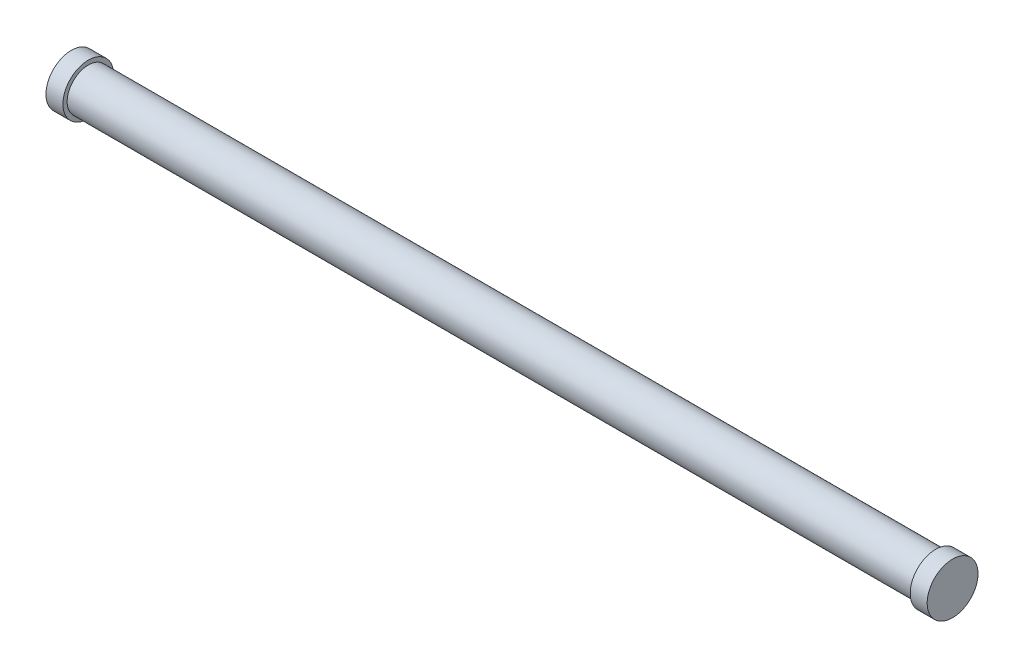
ISO-10303-21;
HEADER;
FILE_DESCRIPTION(('STEP AP214'),'2;1');
FILE_NAME('part.step','',(''),(''),'','','');
FILE_SCHEMA(('AUTOMOTIVE_DESIGN { 1 0 10303 214 1 1 1 1 }'));
ENDSEC;
DATA;
#1=APPLICATION_CONTEXT('core data for automotive mechanical design processes');
#2=APPLICATION_PROTOCOL_DEFINITION('international standard','automotive_design',2000,#1);
#3=PRODUCT_CONTEXT('',#1,'mechanical');
#4=PRODUCT('Part','Part','',(#3));
#5=PRODUCT_RELATED_PRODUCT_CATEGORY('part','',(#4));
#6=PRODUCT_DEFINITION_FORMATION('','',#4);
#7=PRODUCT_DEFINITION_CONTEXT('part definition',#1,'design');
#8=PRODUCT_DEFINITION('design','',#6,#7);
#9=PRODUCT_DEFINITION_SHAPE('','',#8);
#10=(LENGTH_UNIT() NAMED_UNIT(*) SI_UNIT(.MILLI.,.METRE.));
#11=(NAMED_UNIT(*) PLANE_ANGLE_UNIT() SI_UNIT($,.RADIAN.));
#12=(NAMED_UNIT(*) SI_UNIT($,.STERADIAN.) SOLID_ANGLE_UNIT());
#13=UNCERTAINTY_MEASURE_WITH_UNIT(LENGTH_MEASURE(1.E-05),#10,'distance_accuracy_value','');
#14=(GEOMETRIC_REPRESENTATION_CONTEXT(3) GLOBAL_UNCERTAINTY_ASSIGNED_CONTEXT((#13)) GLOBAL_UNIT_ASSIGNED_CONTEXT((#10,
#11,#12)) REPRESENTATION_CONTEXT('',''));
#15=CARTESIAN_POINT('',(0.,0.,0.));
#16=DIRECTION('',(0.,0.,1.));
#17=DIRECTION('',(1.,0.,0.));
#18=AXIS2_PLACEMENT_3D('',#15,#16,#17);
#19=CARTESIAN_POINT('',(0.508,0.,0.));
#20=DIRECTION('',(-1.,0.,0.));
#21=DIRECTION('',(0.,0.,1.));
#22=AXIS2_PLACEMENT_3D('',#19,#20,#21);
#23=CYLINDRICAL_SURFACE('',#22,0.761999999999999);
#24=CARTESIAN_POINT('',(0.508,0.,0.));
#25=DIRECTION('',(1.,0.,0.));
#26=DIRECTION('',(0.,0.,-1.));
#27=AXIS2_PLACEMENT_3D('',#24,#25,#26);
#28=CIRCLE('',#27,0.761999999999999);
#29=CARTESIAN_POINT('',(0.508,0.,-0.761999999999999));
#30=VERTEX_POINT('',#29);
#31=EDGE_CURVE('E48',#30,#30,#28,.T.);
#32=ORIENTED_EDGE('',*,*,#31,.F.);
#33=EDGE_LOOP('',(#32));
#34=FACE_BOUND('',#33,.T.);
#35=CARTESIAN_POINT('',(0.,0.,0.));
#36=DIRECTION('',(1.,0.,0.));
#37=DIRECTION('',(0.,0.,-1.));
#38=AXIS2_PLACEMENT_3D('',#35,#36,#37);
#39=CIRCLE('',#38,0.761999999999999);
#40=CARTESIAN_POINT('',(0.,0.,-0.761999999999999));
#41=VERTEX_POINT('',#40);
#42=EDGE_CURVE('E43',#41,#41,#39,.T.);
#43=ORIENTED_EDGE('',*,*,#42,.T.);
#44=EDGE_LOOP('',(#43));
#45=FACE_BOUND('',#44,.T.);
#46=ADVANCED_FACE('F40',(#34,#45),#23,.T.);
#47=CARTESIAN_POINT('',(0.508,0.,0.));
#48=DIRECTION('',(1.,0.,0.));
#49=DIRECTION('',(0.,0.,-1.));
#50=AXIS2_PLACEMENT_3D('',#47,#48,#49);
#51=PLANE('',#50);
#52=CARTESIAN_POINT('',(0.508,0.,0.));
#53=DIRECTION('',(1.,0.,0.));
#54=DIRECTION('',(0.,0.,-1.));
#55=AXIS2_PLACEMENT_3D('',#52,#53,#54);
#56=CIRCLE('',#55,0.635);
#57=CARTESIAN_POINT('',(0.508,0.,-0.635));
#58=VERTEX_POINT('',#57);
#59=EDGE_CURVE('E10',#58,#58,#56,.T.);
#60=ORIENTED_EDGE('',*,*,#59,.F.);
#61=EDGE_LOOP('',(#60));
#62=FACE_BOUND('',#61,.T.);
#63=ORIENTED_EDGE('',*,*,#31,.T.);
#64=EDGE_LOOP('',(#63));
#65=FACE_BOUND('',#64,.T.);
#66=ADVANCED_FACE('F88',(#62,#65),#51,.T.);
#67=CARTESIAN_POINT('',(0.,0.,0.));
#68=DIRECTION('',(1.,0.,0.));
#69=DIRECTION('',(0.,0.,-1.));
#70=AXIS2_PLACEMENT_3D('',#67,#68,#69);
#71=PLANE('',#70);
#72=ORIENTED_EDGE('',*,*,#42,.F.);
#73=EDGE_LOOP('',(#72));
#74=FACE_BOUND('',#73,.T.);
#75=ADVANCED_FACE('F93',(#74),#71,.F.);
#76=CARTESIAN_POINT('',(25.908,0.,0.));
#77=DIRECTION('',(-1.,0.,0.));
#78=DIRECTION('',(0.,0.,1.));
#79=AXIS2_PLACEMENT_3D('',#76,#77,#78);
#80=CYLINDRICAL_SURFACE('',#79,0.635);
#81=CARTESIAN_POINT('',(25.908,0.,0.));
#82=DIRECTION('',(1.,0.,0.));
#83=DIRECTION('',(0.,0.,-1.));
#84=AXIS2_PLACEMENT_3D('',#81,#82,#83);
#85=CIRCLE('',#84,0.635);
#86=CARTESIAN_POINT('',(25.908,0.,-0.635));
#87=VERTEX_POINT('',#86);
#88=EDGE_CURVE('E56',#87,#87,#85,.T.);
#89=ORIENTED_EDGE('',*,*,#88,.F.);
#90=EDGE_LOOP('',(#89));
#91=FACE_BOUND('',#90,.T.);
#92=ORIENTED_EDGE('',*,*,#59,.T.);
#93=EDGE_LOOP('',(#92));
#94=FACE_BOUND('',#93,.T.);
#95=ADVANCED_FACE('F75',(#91,#94),#80,.T.);
#96=CARTESIAN_POINT('',(26.416,0.,0.));
#97=DIRECTION('',(-1.,0.,0.));
#98=DIRECTION('',(0.,0.,1.));
#99=AXIS2_PLACEMENT_3D('',#96,#97,#98);
#100=CYLINDRICAL_SURFACE('',#99,0.761999999999999);
#101=CARTESIAN_POINT('',(26.416,0.,0.));
#102=DIRECTION('',(1.,0.,0.));
#103=DIRECTION('',(0.,0.,-1.));
#104=AXIS2_PLACEMENT_3D('',#101,#102,#103);
#105=CIRCLE('',#104,0.761999999999999);
#106=CARTESIAN_POINT('',(26.416,0.,-0.761999999999999));
#107=VERTEX_POINT('',#106);
#108=EDGE_CURVE('E60',#107,#107,#105,.T.);
#109=ORIENTED_EDGE('',*,*,#108,.F.);
#110=EDGE_LOOP('',(#109));
#111=FACE_BOUND('',#110,.T.);
#112=CARTESIAN_POINT('',(25.908,0.,0.));
#113=DIRECTION('',(1.,0.,0.));
#114=DIRECTION('',(0.,0.,-1.));
#115=AXIS2_PLACEMENT_3D('',#112,#113,#114);
#116=CIRCLE('',#115,0.761999999999999);
#117=CARTESIAN_POINT('',(25.908,0.,-0.761999999999999));
#118=VERTEX_POINT('',#117);
#119=EDGE_CURVE('E61',#118,#118,#116,.T.);
#120=ORIENTED_EDGE('',*,*,#119,.T.);
#121=EDGE_LOOP('',(#120));
#122=FACE_BOUND('',#121,.T.);
#123=ADVANCED_FACE('F72',(#111,#122),#100,.T.);
#124=CARTESIAN_POINT('',(26.416,0.,0.));
#125=DIRECTION('',(1.,0.,0.));
#126=DIRECTION('',(0.,0.,-1.));
#127=AXIS2_PLACEMENT_3D('',#124,#125,#126);
#128=PLANE('',#127);
#129=ORIENTED_EDGE('',*,*,#108,.T.);
#130=EDGE_LOOP('',(#129));
#131=FACE_BOUND('',#130,.T.);
#132=ADVANCED_FACE('F70',(#131),#128,.T.);
#133=CARTESIAN_POINT('',(25.908,0.,0.));
#134=DIRECTION('',(1.,0.,0.));
#135=DIRECTION('',(0.,0.,-1.));
#136=AXIS2_PLACEMENT_3D('',#133,#134,#135);
#137=PLANE('',#136);
#138=ORIENTED_EDGE('',*,*,#88,.T.);
#139=EDGE_LOOP('',(#138));
#140=FACE_BOUND('',#139,.T.);
#141=ORIENTED_EDGE('',*,*,#119,.F.);
#142=EDGE_LOOP('',(#141));
#143=FACE_BOUND('',#142,.T.);
#144=ADVANCED_FACE('F79',(#140,#143),#137,.F.);
#145=CLOSED_SHELL('',(#46,#66,#75,#95,#123,#132,#144));
#146=MANIFOLD_SOLID_BREP('B2',#145);
#147=ADVANCED_BREP_SHAPE_REPRESENTATION('',(#18,#146),#14);
#148=SHAPE_DEFINITION_REPRESENTATION(#9,#147);
ENDSEC;
END-ISO-10303-21;
